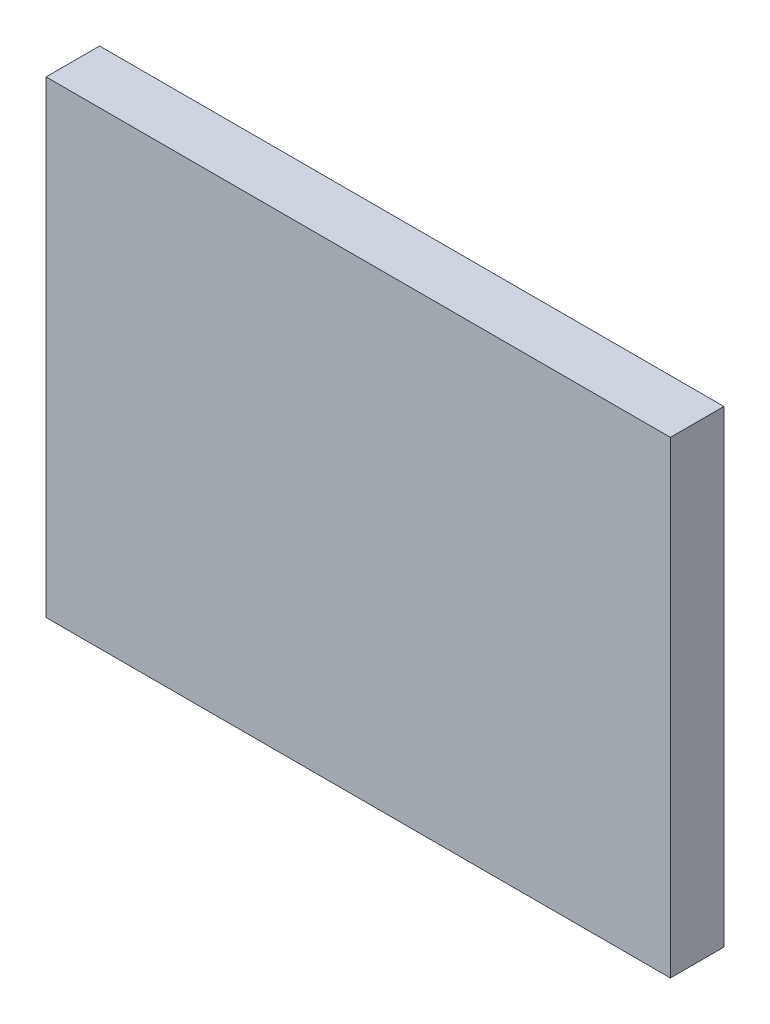
ISO-10303-21;
HEADER;
FILE_DESCRIPTION(('STEP AP214'),'2;1');
FILE_NAME('part.step','',(''),(''),'','','');
FILE_SCHEMA(('AUTOMOTIVE_DESIGN { 1 0 10303 214 1 1 1 1 }'));
ENDSEC;
DATA;
#1=APPLICATION_CONTEXT('core data for automotive mechanical design processes');
#2=APPLICATION_PROTOCOL_DEFINITION('international standard','automotive_design',2000,#1);
#3=PRODUCT_CONTEXT('',#1,'mechanical');
#4=PRODUCT('Part','Part','',(#3));
#5=PRODUCT_RELATED_PRODUCT_CATEGORY('part','',(#4));
#6=PRODUCT_DEFINITION_FORMATION('','',#4);
#7=PRODUCT_DEFINITION_CONTEXT('part definition',#1,'design');
#8=PRODUCT_DEFINITION('design','',#6,#7);
#9=PRODUCT_DEFINITION_SHAPE('','',#8);
#10=(LENGTH_UNIT() NAMED_UNIT(*) SI_UNIT(.MILLI.,.METRE.));
#11=(NAMED_UNIT(*) PLANE_ANGLE_UNIT() SI_UNIT($,.RADIAN.));
#12=(NAMED_UNIT(*) SI_UNIT($,.STERADIAN.) SOLID_ANGLE_UNIT());
#13=UNCERTAINTY_MEASURE_WITH_UNIT(LENGTH_MEASURE(1.E-05),#10,'distance_accuracy_value','');
#14=(GEOMETRIC_REPRESENTATION_CONTEXT(3) GLOBAL_UNCERTAINTY_ASSIGNED_CONTEXT((#13)) GLOBAL_UNIT_ASSIGNED_CONTEXT((#10,
#11,#12)) REPRESENTATION_CONTEXT('',''));
#15=CARTESIAN_POINT('',(0.,0.,0.));
#16=DIRECTION('',(0.,0.,1.));
#17=DIRECTION('',(1.,0.,0.));
#18=AXIS2_PLACEMENT_3D('',#15,#16,#17);
#19=CARTESIAN_POINT('',(2.5146,7.955108,0.76487));
#20=DIRECTION('',(0.,0.,-1.));
#21=DIRECTION('',(0.,1.,0.));
#22=AXIS2_PLACEMENT_3D('',#19,#20,#21);
#23=PLANE('',#22);
#24=DIRECTION('',(1.,0.,0.));
#25=VECTOR('',#24,1.);
#26=CARTESIAN_POINT('',(2.3146,8.105108,0.76487));
#27=LINE('',#26,#25);
#28=CARTESIAN_POINT('',(2.3146,8.105108,0.76487));
#29=VERTEX_POINT('',#28);
#30=CARTESIAN_POINT('',(2.7146,8.105108,0.76487));
#31=VERTEX_POINT('',#30);
#32=EDGE_CURVE('E55',#29,#31,#27,.T.);
#33=ORIENTED_EDGE('',*,*,#32,.T.);
#34=DIRECTION('',(0.,1.,0.));
#35=VECTOR('',#34,1.);
#36=CARTESIAN_POINT('',(2.7146,8.105108,0.76487));
#37=LINE('',#36,#35);
#38=CARTESIAN_POINT('',(2.7146,7.805108,0.76487));
#39=VERTEX_POINT('',#38);
#40=EDGE_CURVE('E57',#31,#39,#37,.F.);
#41=ORIENTED_EDGE('',*,*,#40,.T.);
#42=DIRECTION('',(1.,0.,0.));
#43=VECTOR('',#42,1.);
#44=CARTESIAN_POINT('',(2.7146,7.805108,0.76487));
#45=LINE('',#44,#43);
#46=CARTESIAN_POINT('',(2.3146,7.805108,0.76487));
#47=VERTEX_POINT('',#46);
#48=EDGE_CURVE('E20',#39,#47,#45,.F.);
#49=ORIENTED_EDGE('',*,*,#48,.T.);
#50=DIRECTION('',(0.,1.,0.));
#51=VECTOR('',#50,1.);
#52=CARTESIAN_POINT('',(2.3146,7.805108,0.76487));
#53=LINE('',#52,#51);
#54=EDGE_CURVE('E80',#47,#29,#53,.T.);
#55=ORIENTED_EDGE('',*,*,#54,.T.);
#56=EDGE_LOOP('',(#33,#41,#49,#55));
#57=FACE_BOUND('',#56,.T.);
#58=ADVANCED_FACE('F17',(#57),#23,.T.);
#59=CARTESIAN_POINT('',(2.7146,7.805108,0.76487));
#60=DIRECTION('',(0.,1.,0.));
#61=DIRECTION('',(0.,0.,1.));
#62=AXIS2_PLACEMENT_3D('',#59,#60,#61);
#63=PLANE('',#62);
#64=DIRECTION('',(0.,0.,-1.));
#65=VECTOR('',#64,1.);
#66=CARTESIAN_POINT('',(2.3146,7.805108,0.76487));
#67=LINE('',#66,#65);
#68=CARTESIAN_POINT('',(2.3146,7.805108,0.79916));
#69=VERTEX_POINT('',#68);
#70=EDGE_CURVE('E68',#69,#47,#67,.T.);
#71=ORIENTED_EDGE('',*,*,#70,.T.);
#72=ORIENTED_EDGE('',*,*,#48,.F.);
#73=DIRECTION('',(0.,0.,1.));
#74=VECTOR('',#73,1.);
#75=CARTESIAN_POINT('',(2.7146,7.805108,0.76487));
#76=LINE('',#75,#74);
#77=CARTESIAN_POINT('',(2.7146,7.805108,0.79916));
#78=VERTEX_POINT('',#77);
#79=EDGE_CURVE('E63',#39,#78,#76,.T.);
#80=ORIENTED_EDGE('',*,*,#79,.T.);
#81=DIRECTION('',(1.,0.,0.));
#82=VECTOR('',#81,1.);
#83=CARTESIAN_POINT('',(2.5146,7.805108,0.79916));
#84=LINE('',#83,#82);
#85=EDGE_CURVE('E83',#69,#78,#84,.T.);
#86=ORIENTED_EDGE('',*,*,#85,.F.);
#87=EDGE_LOOP('',(#71,#72,#80,#86));
#88=FACE_BOUND('',#87,.T.);
#89=ADVANCED_FACE('F65',(#88),#63,.F.);
#90=CARTESIAN_POINT('',(2.7146,8.105108,0.76487));
#91=DIRECTION('',(-1.,0.,0.));
#92=DIRECTION('',(0.,0.,1.));
#93=AXIS2_PLACEMENT_3D('',#90,#91,#92);
#94=PLANE('',#93);
#95=ORIENTED_EDGE('',*,*,#79,.F.);
#96=ORIENTED_EDGE('',*,*,#40,.F.);
#97=DIRECTION('',(0.,0.,-1.));
#98=VECTOR('',#97,1.);
#99=CARTESIAN_POINT('',(2.7146,8.105108,0.76487));
#100=LINE('',#99,#98);
#101=CARTESIAN_POINT('',(2.7146,8.105108,0.79916));
#102=VERTEX_POINT('',#101);
#103=EDGE_CURVE('E75',#31,#102,#100,.F.);
#104=ORIENTED_EDGE('',*,*,#103,.T.);
#105=DIRECTION('',(0.,-1.,0.));
#106=VECTOR('',#105,1.);
#107=CARTESIAN_POINT('',(2.7146,7.955108,0.79916));
#108=LINE('',#107,#106);
#109=EDGE_CURVE('E72',#78,#102,#108,.F.);
#110=ORIENTED_EDGE('',*,*,#109,.F.);
#111=EDGE_LOOP('',(#95,#96,#104,#110));
#112=FACE_BOUND('',#111,.T.);
#113=ADVANCED_FACE('F70',(#112),#94,.F.);
#114=CARTESIAN_POINT('',(2.3146,8.105108,0.76487));
#115=DIRECTION('',(0.,-1.,0.));
#116=DIRECTION('',(0.,0.,-1.));
#117=AXIS2_PLACEMENT_3D('',#114,#115,#116);
#118=PLANE('',#117);
#119=ORIENTED_EDGE('',*,*,#103,.F.);
#120=ORIENTED_EDGE('',*,*,#32,.F.);
#121=DIRECTION('',(0.,0.,-1.));
#122=VECTOR('',#121,1.);
#123=CARTESIAN_POINT('',(2.3146,8.105108,0.76487));
#124=LINE('',#123,#122);
#125=CARTESIAN_POINT('',(2.3146,8.105108,0.79916));
#126=VERTEX_POINT('',#125);
#127=EDGE_CURVE('E35',#29,#126,#124,.F.);
#128=ORIENTED_EDGE('',*,*,#127,.T.);
#129=DIRECTION('',(1.,0.,0.));
#130=VECTOR('',#129,1.);
#131=CARTESIAN_POINT('',(2.5146,8.105108,0.79916));
#132=LINE('',#131,#130);
#133=EDGE_CURVE('E26',#102,#126,#132,.F.);
#134=ORIENTED_EDGE('',*,*,#133,.F.);
#135=EDGE_LOOP('',(#119,#120,#128,#134));
#136=FACE_BOUND('',#135,.T.);
#137=ADVANCED_FACE('F89',(#136),#118,.F.);
#138=CARTESIAN_POINT('',(2.3146,7.805108,0.76487));
#139=DIRECTION('',(1.,0.,0.));
#140=DIRECTION('',(0.,0.,-1.));
#141=AXIS2_PLACEMENT_3D('',#138,#139,#140);
#142=PLANE('',#141);
#143=ORIENTED_EDGE('',*,*,#127,.F.);
#144=ORIENTED_EDGE('',*,*,#54,.F.);
#145=ORIENTED_EDGE('',*,*,#70,.F.);
#146=DIRECTION('',(0.,-1.,0.));
#147=VECTOR('',#146,1.);
#148=CARTESIAN_POINT('',(2.3146,7.955108,0.79916));
#149=LINE('',#148,#147);
#150=EDGE_CURVE('E11',#126,#69,#149,.T.);
#151=ORIENTED_EDGE('',*,*,#150,.F.);
#152=EDGE_LOOP('',(#143,#144,#145,#151));
#153=FACE_BOUND('',#152,.T.);
#154=ADVANCED_FACE('F91',(#153),#142,.F.);
#155=CARTESIAN_POINT('',(2.5146,7.955108,0.79916));
#156=DIRECTION('',(0.,0.,1.));
#157=DIRECTION('',(0.,-1.,0.));
#158=AXIS2_PLACEMENT_3D('',#155,#156,#157);
#159=PLANE('',#158);
#160=ORIENTED_EDGE('',*,*,#133,.T.);
#161=ORIENTED_EDGE('',*,*,#150,.T.);
#162=ORIENTED_EDGE('',*,*,#85,.T.);
#163=ORIENTED_EDGE('',*,*,#109,.T.);
#164=EDGE_LOOP('',(#160,#161,#162,#163));
#165=FACE_BOUND('',#164,.T.);
#166=ADVANCED_FACE('F88',(#165),#159,.T.);
#167=CLOSED_SHELL('',(#58,#89,#113,#137,#154,#166));
#168=MANIFOLD_SOLID_BREP('B1',#167);
#169=ADVANCED_BREP_SHAPE_REPRESENTATION('',(#18,#168),#14);
#170=SHAPE_DEFINITION_REPRESENTATION(#9,#169);
ENDSEC;
END-ISO-10303-21;
